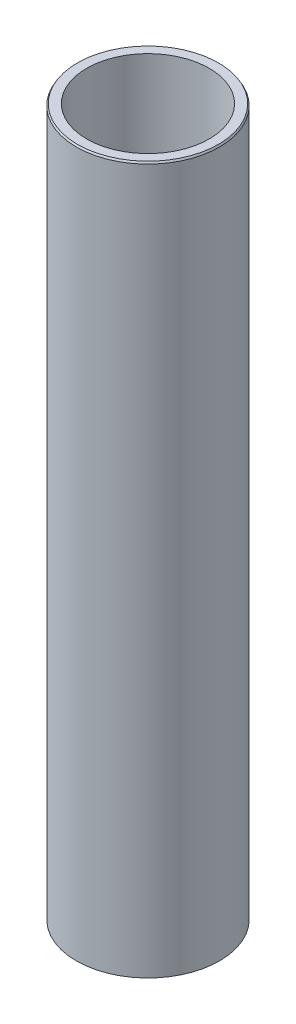
ISO-10303-21;
HEADER;
FILE_DESCRIPTION(('STEP AP214'),'2;1');
FILE_NAME('part.step','',(''),(''),'','','');
FILE_SCHEMA(('AUTOMOTIVE_DESIGN { 1 0 10303 214 1 1 1 1 }'));
ENDSEC;
DATA;
#1=APPLICATION_CONTEXT('core data for automotive mechanical design processes');
#2=APPLICATION_PROTOCOL_DEFINITION('international standard','automotive_design',2000,#1);
#3=PRODUCT_CONTEXT('',#1,'mechanical');
#4=PRODUCT('Part','Part','',(#3));
#5=PRODUCT_RELATED_PRODUCT_CATEGORY('part','',(#4));
#6=PRODUCT_DEFINITION_FORMATION('','',#4);
#7=PRODUCT_DEFINITION_CONTEXT('part definition',#1,'design');
#8=PRODUCT_DEFINITION('design','',#6,#7);
#9=PRODUCT_DEFINITION_SHAPE('','',#8);
#10=(LENGTH_UNIT() NAMED_UNIT(*) SI_UNIT(.MILLI.,.METRE.));
#11=(NAMED_UNIT(*) PLANE_ANGLE_UNIT() SI_UNIT($,.RADIAN.));
#12=(NAMED_UNIT(*) SI_UNIT($,.STERADIAN.) SOLID_ANGLE_UNIT());
#13=UNCERTAINTY_MEASURE_WITH_UNIT(LENGTH_MEASURE(1.E-05),#10,'distance_accuracy_value','');
#14=(GEOMETRIC_REPRESENTATION_CONTEXT(3) GLOBAL_UNCERTAINTY_ASSIGNED_CONTEXT((#13)) GLOBAL_UNIT_ASSIGNED_CONTEXT((#10,
#11,#12)) REPRESENTATION_CONTEXT('',''));
#15=CARTESIAN_POINT('',(0.,0.,0.));
#16=DIRECTION('',(0.,0.,1.));
#17=DIRECTION('',(1.,0.,0.));
#18=AXIS2_PLACEMENT_3D('',#15,#16,#17);
#19=CARTESIAN_POINT('',(0.,518.875283416382,0.));
#20=DIRECTION('',(0.,-1.,0.));
#21=DIRECTION('',(0.,0.,-1.));
#22=AXIS2_PLACEMENT_3D('',#19,#20,#21);
#23=CYLINDRICAL_SURFACE('',#22,52.5);
#24=CARTESIAN_POINT('',(0.,517.552138768976,0.));
#25=DIRECTION('',(0.,1.,0.));
#26=DIRECTION('',(0.,0.,1.));
#27=AXIS2_PLACEMENT_3D('',#24,#25,#26);
#28=CIRCLE('',#27,52.5);
#29=CARTESIAN_POINT('',(0.,517.552138768976,52.5));
#30=VERTEX_POINT('',#29);
#31=EDGE_CURVE('E50',#30,#30,#28,.F.);
#32=ORIENTED_EDGE('',*,*,#31,.T.);
#33=EDGE_LOOP('',(#32));
#34=FACE_BOUND('',#33,.T.);
#35=CARTESIAN_POINT('',(0.,0.763917918356283,0.));
#36=DIRECTION('',(0.,1.,0.));
#37=DIRECTION('',(0.,0.,1.));
#38=AXIS2_PLACEMENT_3D('',#35,#36,#37);
#39=CIRCLE('',#38,52.5);
#40=CARTESIAN_POINT('',(0.,0.763917918356283,52.5));
#41=VERTEX_POINT('',#40);
#42=EDGE_CURVE('E51',#41,#41,#39,.T.);
#43=ORIENTED_EDGE('',*,*,#42,.T.);
#44=EDGE_LOOP('',(#43));
#45=FACE_BOUND('',#44,.T.);
#46=ADVANCED_FACE('F39',(#34,#45),#23,.T.);
#47=CARTESIAN_POINT('',(0.,518.875283416382,0.));
#48=DIRECTION('',(0.,1.,0.));
#49=DIRECTION('',(0.,0.,1.));
#50=AXIS2_PLACEMENT_3D('',#47,#48,#49);
#51=PLANE('',#50);
#52=CARTESIAN_POINT('',(0.,518.875283416382,0.));
#53=DIRECTION('',(0.,1.,0.));
#54=DIRECTION('',(0.,0.,1.));
#55=AXIS2_PLACEMENT_3D('',#52,#53,#54);
#56=CIRCLE('',#55,51.7360820816435);
#57=CARTESIAN_POINT('',(0.,518.875283416382,51.7360820816435));
#58=VERTEX_POINT('',#57);
#59=EDGE_CURVE('E54',#58,#58,#56,.T.);
#60=ORIENTED_EDGE('',*,*,#59,.T.);
#61=EDGE_LOOP('',(#60));
#62=FACE_BOUND('',#61,.T.);
#63=CARTESIAN_POINT('',(0.,518.875283416382,0.));
#64=DIRECTION('',(0.,1.,0.));
#65=DIRECTION('',(0.,0.,1.));
#66=AXIS2_PLACEMENT_3D('',#63,#64,#65);
#67=CIRCLE('',#66,44.9207970729292);
#68=CARTESIAN_POINT('',(0.,518.875283416382,44.9207970729292));
#69=VERTEX_POINT('',#68);
#70=EDGE_CURVE('E58',#69,#69,#67,.T.);
#71=ORIENTED_EDGE('',*,*,#70,.F.);
#72=EDGE_LOOP('',(#71));
#73=FACE_BOUND('',#72,.T.);
#74=ADVANCED_FACE('F69',(#62,#73),#51,.T.);
#75=CARTESIAN_POINT('',(0.,0.,0.));
#76=DIRECTION('',(0.,1.,0.));
#77=DIRECTION('',(0.,0.,1.));
#78=AXIS2_PLACEMENT_3D('',#75,#76,#77);
#79=PLANE('',#78);
#80=CARTESIAN_POINT('',(0.,0.,0.));
#81=DIRECTION('',(0.,1.,0.));
#82=DIRECTION('',(0.,0.,1.));
#83=AXIS2_PLACEMENT_3D('',#80,#81,#82);
#84=CIRCLE('',#83,51.1768553525946);
#85=CARTESIAN_POINT('',(0.,0.,51.1768553525946));
#86=VERTEX_POINT('',#85);
#87=EDGE_CURVE('E10',#86,#86,#84,.F.);
#88=ORIENTED_EDGE('',*,*,#87,.T.);
#89=EDGE_LOOP('',(#88));
#90=FACE_BOUND('',#89,.T.);
#91=CARTESIAN_POINT('',(0.,0.,0.));
#92=DIRECTION('',(0.,1.,0.));
#93=DIRECTION('',(0.,0.,1.));
#94=AXIS2_PLACEMENT_3D('',#91,#92,#93);
#95=CIRCLE('',#94,44.9207970729292);
#96=CARTESIAN_POINT('',(0.,0.,44.9207970729292));
#97=VERTEX_POINT('',#96);
#98=EDGE_CURVE('E63',#97,#97,#95,.T.);
#99=ORIENTED_EDGE('',*,*,#98,.T.);
#100=EDGE_LOOP('',(#99));
#101=FACE_BOUND('',#100,.T.);
#102=ADVANCED_FACE('F75',(#90,#101),#79,.F.);
#103=CARTESIAN_POINT('',(0.,518.875283416382,0.));
#104=DIRECTION('',(0.,-1.,0.));
#105=DIRECTION('',(0.,0.,-1.));
#106=AXIS2_PLACEMENT_3D('',#103,#104,#105);
#107=CYLINDRICAL_SURFACE('',#106,44.9207970729292);
#108=ORIENTED_EDGE('',*,*,#70,.T.);
#109=EDGE_LOOP('',(#108));
#110=FACE_BOUND('',#109,.T.);
#111=ORIENTED_EDGE('',*,*,#98,.F.);
#112=EDGE_LOOP('',(#111));
#113=FACE_BOUND('',#112,.T.);
#114=ADVANCED_FACE('F70',(#110,#113),#107,.F.);
#115=CARTESIAN_POINT('',(0.,518.875283416382,0.));
#116=DIRECTION('',(0.,-1.,0.));
#117=DIRECTION('',(0.,0.,-1.));
#118=AXIS2_PLACEMENT_3D('',#115,#116,#117);
#119=CONICAL_SURFACE('',#118,51.7360820816435,0.52359877559832);
#120=ORIENTED_EDGE('',*,*,#31,.F.);
#121=EDGE_LOOP('',(#120));
#122=FACE_BOUND('',#121,.T.);
#123=ORIENTED_EDGE('',*,*,#59,.F.);
#124=EDGE_LOOP('',(#123));
#125=FACE_BOUND('',#124,.T.);
#126=ADVANCED_FACE('F81',(#122,#125),#119,.T.);
#127=CARTESIAN_POINT('',(0.,0.763917918356283,0.));
#128=DIRECTION('',(0.,1.,0.));
#129=DIRECTION('',(0.,0.,1.));
#130=AXIS2_PLACEMENT_3D('',#127,#128,#129);
#131=CONICAL_SURFACE('',#130,52.5,1.04719755119662);
#132=ORIENTED_EDGE('',*,*,#87,.F.);
#133=EDGE_LOOP('',(#132));
#134=FACE_BOUND('',#133,.T.);
#135=ORIENTED_EDGE('',*,*,#42,.F.);
#136=EDGE_LOOP('',(#135));
#137=FACE_BOUND('',#136,.T.);
#138=ADVANCED_FACE('F45',(#134,#137),#131,.T.);
#139=CLOSED_SHELL('',(#46,#74,#102,#114,#126,#138));
#140=MANIFOLD_SOLID_BREP('B2',#139);
#141=ADVANCED_BREP_SHAPE_REPRESENTATION('',(#18,#140),#14);
#142=SHAPE_DEFINITION_REPRESENTATION(#9,#141);
ENDSEC;
END-ISO-10303-21;
